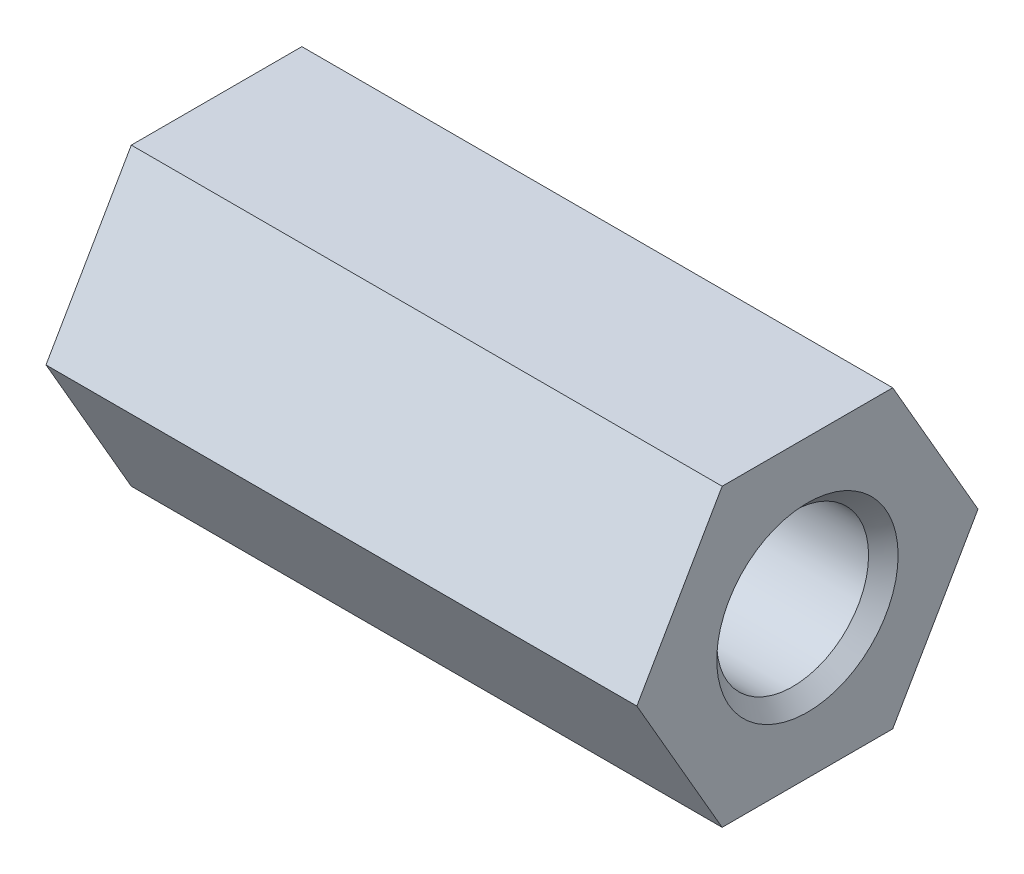
ISO-10303-21;
HEADER;
FILE_DESCRIPTION(('STEP AP214'),'2;1');
FILE_NAME('part.step','',(''),(''),'','','');
FILE_SCHEMA(('AUTOMOTIVE_DESIGN { 1 0 10303 214 1 1 1 1 }'));
ENDSEC;
DATA;
#1=APPLICATION_CONTEXT('core data for automotive mechanical design processes');
#2=APPLICATION_PROTOCOL_DEFINITION('international standard','automotive_design',2000,#1);
#3=PRODUCT_CONTEXT('',#1,'mechanical');
#4=PRODUCT('Part','Part','',(#3));
#5=PRODUCT_RELATED_PRODUCT_CATEGORY('part','',(#4));
#6=PRODUCT_DEFINITION_FORMATION('','',#4);
#7=PRODUCT_DEFINITION_CONTEXT('part definition',#1,'design');
#8=PRODUCT_DEFINITION('design','',#6,#7);
#9=PRODUCT_DEFINITION_SHAPE('','',#8);
#10=(LENGTH_UNIT() NAMED_UNIT(*) SI_UNIT(.MILLI.,.METRE.));
#11=(NAMED_UNIT(*) PLANE_ANGLE_UNIT() SI_UNIT($,.RADIAN.));
#12=(NAMED_UNIT(*) SI_UNIT($,.STERADIAN.) SOLID_ANGLE_UNIT());
#13=UNCERTAINTY_MEASURE_WITH_UNIT(LENGTH_MEASURE(1.E-05),#10,'distance_accuracy_value','');
#14=(GEOMETRIC_REPRESENTATION_CONTEXT(3) GLOBAL_UNCERTAINTY_ASSIGNED_CONTEXT((#13)) GLOBAL_UNIT_ASSIGNED_CONTEXT((#10,
#11,#12)) REPRESENTATION_CONTEXT('',''));
#15=CARTESIAN_POINT('',(0.,0.,0.));
#16=DIRECTION('',(0.,0.,1.));
#17=DIRECTION('',(1.,0.,0.));
#18=AXIS2_PLACEMENT_3D('',#15,#16,#17);
#19=CARTESIAN_POINT('',(25.4,-6.34999999999993,-3.66617420935418));
#20=DIRECTION('',(0.,0.499999999999995,0.866025403784441));
#21=DIRECTION('',(0.,-0.866025403784442,0.499999999999995));
#22=AXIS2_PLACEMENT_3D('',#19,#20,#21);
#23=PLANE('',#22);
#24=DIRECTION('',(0.,0.866025403784441,-0.499999999999995));
#25=VECTOR('',#24,1.);
#26=CARTESIAN_POINT('',(0.,-6.34999999999993,-3.66617420935418));
#27=LINE('',#26,#25);
#28=CARTESIAN_POINT('',(0.,-6.34999999999993,-3.66617420935418));
#29=VERTEX_POINT('',#28);
#30=CARTESIAN_POINT('',(0.,0.,-7.33234841870822));
#31=VERTEX_POINT('',#30);
#32=EDGE_CURVE('E117',#29,#31,#27,.T.);
#33=ORIENTED_EDGE('',*,*,#32,.T.);
#34=DIRECTION('',(-1.,0.,0.));
#35=VECTOR('',#34,1.);
#36=CARTESIAN_POINT('',(25.4,0.,-7.33234841870822));
#37=LINE('',#36,#35);
#38=CARTESIAN_POINT('',(25.4,0.,-7.33234841870822));
#39=VERTEX_POINT('',#38);
#40=EDGE_CURVE('E11',#39,#31,#37,.T.);
#41=ORIENTED_EDGE('',*,*,#40,.F.);
#42=DIRECTION('',(0.,0.866025403784441,-0.499999999999995));
#43=VECTOR('',#42,1.);
#44=CARTESIAN_POINT('',(25.4,-6.34999999999993,-3.66617420935418));
#45=LINE('',#44,#43);
#46=CARTESIAN_POINT('',(25.4,-6.34999999999993,-3.66617420935418));
#47=VERTEX_POINT('',#46);
#48=EDGE_CURVE('E128',#47,#39,#45,.T.);
#49=ORIENTED_EDGE('',*,*,#48,.F.);
#50=DIRECTION('',(-1.,0.,0.));
#51=VECTOR('',#50,1.);
#52=CARTESIAN_POINT('',(25.4,-6.34999999999993,-3.66617420935418));
#53=LINE('',#52,#51);
#54=EDGE_CURVE('E113',#47,#29,#53,.T.);
#55=ORIENTED_EDGE('',*,*,#54,.T.);
#56=EDGE_LOOP('',(#33,#41,#49,#55));
#57=FACE_BOUND('',#56,.T.);
#58=ADVANCED_FACE('F33',(#57),#23,.F.);
#59=CARTESIAN_POINT('',(25.4,0.,-7.33234841870822));
#60=DIRECTION('',(0.,-0.500000000000001,0.866025403784438));
#61=DIRECTION('',(0.,-0.866025403784438,-0.500000000000001));
#62=AXIS2_PLACEMENT_3D('',#59,#60,#61);
#63=PLANE('',#62);
#64=DIRECTION('',(0.,0.866025403784438,0.500000000000001));
#65=VECTOR('',#64,1.);
#66=CARTESIAN_POINT('',(0.,0.,-7.33234841870822));
#67=LINE('',#66,#65);
#68=CARTESIAN_POINT('',(0.,6.34999999999999,-3.6661742093541));
#69=VERTEX_POINT('',#68);
#70=EDGE_CURVE('E120',#31,#69,#67,.T.);
#71=ORIENTED_EDGE('',*,*,#70,.T.);
#72=DIRECTION('',(-1.,0.,0.));
#73=VECTOR('',#72,1.);
#74=CARTESIAN_POINT('',(25.4,6.34999999999999,-3.6661742093541));
#75=LINE('',#74,#73);
#76=CARTESIAN_POINT('',(25.4,6.34999999999999,-3.6661742093541));
#77=VERTEX_POINT('',#76);
#78=EDGE_CURVE('E41',#77,#69,#75,.T.);
#79=ORIENTED_EDGE('',*,*,#78,.F.);
#80=DIRECTION('',(0.,0.866025403784438,0.500000000000001));
#81=VECTOR('',#80,1.);
#82=CARTESIAN_POINT('',(25.4,0.,-7.33234841870822));
#83=LINE('',#82,#81);
#84=EDGE_CURVE('E86',#39,#77,#83,.T.);
#85=ORIENTED_EDGE('',*,*,#84,.F.);
#86=ORIENTED_EDGE('',*,*,#40,.T.);
#87=EDGE_LOOP('',(#71,#79,#85,#86));
#88=FACE_BOUND('',#87,.T.);
#89=ADVANCED_FACE('F153',(#88),#63,.F.);
#90=CARTESIAN_POINT('',(25.4,6.34999999999999,-3.6661742093541));
#91=DIRECTION('',(0.,-1.,0.));
#92=DIRECTION('',(0.,0.,-1.));
#93=AXIS2_PLACEMENT_3D('',#90,#91,#92);
#94=PLANE('',#93);
#95=DIRECTION('',(0.,0.,1.));
#96=VECTOR('',#95,1.);
#97=CARTESIAN_POINT('',(0.,6.34999999999999,-3.6661742093541));
#98=LINE('',#97,#96);
#99=CARTESIAN_POINT('',(0.,6.34999999999996,3.66617420935414));
#100=VERTEX_POINT('',#99);
#101=EDGE_CURVE('E123',#69,#100,#98,.T.);
#102=ORIENTED_EDGE('',*,*,#101,.T.);
#103=DIRECTION('',(-1.,0.,0.));
#104=VECTOR('',#103,1.);
#105=CARTESIAN_POINT('',(25.4,6.34999999999996,3.66617420935414));
#106=LINE('',#105,#104);
#107=CARTESIAN_POINT('',(25.4,6.34999999999996,3.66617420935414));
#108=VERTEX_POINT('',#107);
#109=EDGE_CURVE('E108',#108,#100,#106,.T.);
#110=ORIENTED_EDGE('',*,*,#109,.F.);
#111=DIRECTION('',(0.,0.,1.));
#112=VECTOR('',#111,1.);
#113=CARTESIAN_POINT('',(25.4,6.34999999999999,-3.6661742093541));
#114=LINE('',#113,#112);
#115=EDGE_CURVE('E99',#77,#108,#114,.T.);
#116=ORIENTED_EDGE('',*,*,#115,.F.);
#117=ORIENTED_EDGE('',*,*,#78,.T.);
#118=EDGE_LOOP('',(#102,#110,#116,#117));
#119=FACE_BOUND('',#118,.T.);
#120=ADVANCED_FACE('F134',(#119),#94,.F.);
#121=CARTESIAN_POINT('',(25.4,6.34999999999996,3.66617420935414));
#122=DIRECTION('',(0.,-0.499999999999995,-0.866025403784442));
#123=DIRECTION('',(0.,0.866025403784442,-0.499999999999995));
#124=AXIS2_PLACEMENT_3D('',#121,#122,#123);
#125=PLANE('',#124);
#126=DIRECTION('',(0.,-0.866025403784442,0.499999999999995));
#127=VECTOR('',#126,1.);
#128=CARTESIAN_POINT('',(0.,6.34999999999996,3.66617420935414));
#129=LINE('',#128,#127);
#130=CARTESIAN_POINT('',(0.,0.,7.33234841870822));
#131=VERTEX_POINT('',#130);
#132=EDGE_CURVE('E107',#100,#131,#129,.T.);
#133=ORIENTED_EDGE('',*,*,#132,.T.);
#134=DIRECTION('',(-1.,0.,0.));
#135=VECTOR('',#134,1.);
#136=CARTESIAN_POINT('',(25.4,0.,7.33234841870822));
#137=LINE('',#136,#135);
#138=CARTESIAN_POINT('',(25.4,0.,7.33234841870822));
#139=VERTEX_POINT('',#138);
#140=EDGE_CURVE('E104',#139,#131,#137,.T.);
#141=ORIENTED_EDGE('',*,*,#140,.F.);
#142=DIRECTION('',(0.,-0.866025403784442,0.499999999999995));
#143=VECTOR('',#142,1.);
#144=CARTESIAN_POINT('',(25.4,6.34999999999996,3.66617420935414));
#145=LINE('',#144,#143);
#146=EDGE_CURVE('E93',#108,#139,#145,.T.);
#147=ORIENTED_EDGE('',*,*,#146,.F.);
#148=ORIENTED_EDGE('',*,*,#109,.T.);
#149=EDGE_LOOP('',(#133,#141,#147,#148));
#150=FACE_BOUND('',#149,.T.);
#151=ADVANCED_FACE('F105',(#150),#125,.F.);
#152=CARTESIAN_POINT('',(25.4,0.,7.33234841870822));
#153=DIRECTION('',(0.,0.500000000000007,-0.866025403784435));
#154=DIRECTION('',(0.,0.866025403784435,0.500000000000007));
#155=AXIS2_PLACEMENT_3D('',#152,#153,#154);
#156=PLANE('',#155);
#157=DIRECTION('',(0.,-0.866025403784435,-0.500000000000007));
#158=VECTOR('',#157,1.);
#159=CARTESIAN_POINT('',(0.,0.,7.33234841870822));
#160=LINE('',#159,#158);
#161=CARTESIAN_POINT('',(0.,-6.35000000000001,3.66617420935405));
#162=VERTEX_POINT('',#161);
#163=EDGE_CURVE('E72',#131,#162,#160,.T.);
#164=ORIENTED_EDGE('',*,*,#163,.T.);
#165=DIRECTION('',(-1.,0.,0.));
#166=VECTOR('',#165,1.);
#167=CARTESIAN_POINT('',(25.4,-6.35000000000001,3.66617420935405));
#168=LINE('',#167,#166);
#169=CARTESIAN_POINT('',(25.4,-6.35000000000001,3.66617420935405));
#170=VERTEX_POINT('',#169);
#171=EDGE_CURVE('E109',#170,#162,#168,.T.);
#172=ORIENTED_EDGE('',*,*,#171,.F.);
#173=DIRECTION('',(0.,-0.866025403784435,-0.500000000000007));
#174=VECTOR('',#173,1.);
#175=CARTESIAN_POINT('',(25.4,0.,7.33234841870822));
#176=LINE('',#175,#174);
#177=EDGE_CURVE('E97',#139,#170,#176,.T.);
#178=ORIENTED_EDGE('',*,*,#177,.F.);
#179=ORIENTED_EDGE('',*,*,#140,.T.);
#180=EDGE_LOOP('',(#164,#172,#178,#179));
#181=FACE_BOUND('',#180,.T.);
#182=ADVANCED_FACE('F111',(#181),#156,.F.);
#183=CARTESIAN_POINT('',(25.4,-6.35000000000001,3.66617420935405));
#184=DIRECTION('',(0.,1.,0.));
#185=DIRECTION('',(0.,0.,1.));
#186=AXIS2_PLACEMENT_3D('',#183,#184,#185);
#187=PLANE('',#186);
#188=DIRECTION('',(0.,0.,-1.));
#189=VECTOR('',#188,1.);
#190=CARTESIAN_POINT('',(0.,-6.35000000000001,3.66617420935405));
#191=LINE('',#190,#189);
#192=EDGE_CURVE('E78',#162,#29,#191,.T.);
#193=ORIENTED_EDGE('',*,*,#192,.T.);
#194=ORIENTED_EDGE('',*,*,#54,.F.);
#195=DIRECTION('',(0.,0.,-1.));
#196=VECTOR('',#195,1.);
#197=CARTESIAN_POINT('',(25.4,-6.35000000000001,3.66617420935405));
#198=LINE('',#197,#196);
#199=EDGE_CURVE('E49',#170,#47,#198,.T.);
#200=ORIENTED_EDGE('',*,*,#199,.F.);
#201=ORIENTED_EDGE('',*,*,#171,.T.);
#202=EDGE_LOOP('',(#193,#194,#200,#201));
#203=FACE_BOUND('',#202,.T.);
#204=ADVANCED_FACE('F141',(#203),#187,.F.);
#205=CARTESIAN_POINT('',(25.4,0.,0.));
#206=DIRECTION('',(1.,0.,0.));
#207=DIRECTION('',(0.,0.,-1.));
#208=AXIS2_PLACEMENT_3D('',#205,#206,#207);
#209=PLANE('',#208);
#210=CARTESIAN_POINT('',(25.4,0.,0.));
#211=DIRECTION('',(1.,0.,0.));
#212=DIRECTION('',(0.,0.,-1.));
#213=AXIS2_PLACEMENT_3D('',#210,#211,#212);
#214=CIRCLE('',#213,3.8989);
#215=CARTESIAN_POINT('',(25.4,0.,-3.8989));
#216=VERTEX_POINT('',#215);
#217=EDGE_CURVE('E219',#216,#216,#214,.T.);
#218=ORIENTED_EDGE('',*,*,#217,.F.);
#219=EDGE_LOOP('',(#218));
#220=FACE_BOUND('',#219,.T.);
#221=ORIENTED_EDGE('',*,*,#48,.T.);
#222=ORIENTED_EDGE('',*,*,#84,.T.);
#223=ORIENTED_EDGE('',*,*,#115,.T.);
#224=ORIENTED_EDGE('',*,*,#146,.T.);
#225=ORIENTED_EDGE('',*,*,#177,.T.);
#226=ORIENTED_EDGE('',*,*,#199,.T.);
#227=EDGE_LOOP('',(#221,#222,#223,#224,#225,#226));
#228=FACE_BOUND('',#227,.T.);
#229=ADVANCED_FACE('F95',(#220,#228),#209,.T.);
#230=CARTESIAN_POINT('',(0.,0.,0.));
#231=DIRECTION('',(1.,0.,0.));
#232=DIRECTION('',(0.,0.,-1.));
#233=AXIS2_PLACEMENT_3D('',#230,#231,#232);
#234=PLANE('',#233);
#235=CARTESIAN_POINT('',(0.,0.,0.));
#236=DIRECTION('',(1.,0.,0.));
#237=DIRECTION('',(0.,0.,-1.));
#238=AXIS2_PLACEMENT_3D('',#235,#236,#237);
#239=CIRCLE('',#238,3.2639);
#240=CARTESIAN_POINT('',(0.,0.,-3.2639));
#241=VERTEX_POINT('',#240);
#242=EDGE_CURVE('E121',#241,#241,#239,.T.);
#243=ORIENTED_EDGE('',*,*,#242,.T.);
#244=EDGE_LOOP('',(#243));
#245=FACE_BOUND('',#244,.T.);
#246=ORIENTED_EDGE('',*,*,#32,.F.);
#247=ORIENTED_EDGE('',*,*,#192,.F.);
#248=ORIENTED_EDGE('',*,*,#163,.F.);
#249=ORIENTED_EDGE('',*,*,#132,.F.);
#250=ORIENTED_EDGE('',*,*,#101,.F.);
#251=ORIENTED_EDGE('',*,*,#70,.F.);
#252=EDGE_LOOP('',(#246,#247,#248,#249,#250,#251));
#253=FACE_BOUND('',#252,.T.);
#254=ADVANCED_FACE('F137',(#245,#253),#234,.F.);
#255=CARTESIAN_POINT('',(25.4,0.,0.));
#256=DIRECTION('',(1.,0.,0.));
#257=DIRECTION('',(0.,0.,-1.));
#258=AXIS2_PLACEMENT_3D('',#255,#256,#257);
#259=CYLINDRICAL_SURFACE('',#258,3.2639);
#260=ORIENTED_EDGE('',*,*,#242,.F.);
#261=EDGE_LOOP('',(#260));
#262=FACE_BOUND('',#261,.T.);
#263=CARTESIAN_POINT('',(24.765,0.,0.));
#264=DIRECTION('',(1.,0.,0.));
#265=DIRECTION('',(0.,0.,-1.));
#266=AXIS2_PLACEMENT_3D('',#263,#264,#265);
#267=CIRCLE('',#266,3.2639);
#268=CARTESIAN_POINT('',(24.765,0.,-3.2639));
#269=VERTEX_POINT('',#268);
#270=EDGE_CURVE('E216',#269,#269,#267,.T.);
#271=ORIENTED_EDGE('',*,*,#270,.T.);
#272=EDGE_LOOP('',(#271));
#273=FACE_BOUND('',#272,.T.);
#274=ADVANCED_FACE('F190',(#262,#273),#259,.F.);
#275=CARTESIAN_POINT('',(25.4,0.,0.));
#276=DIRECTION('',(1.,0.,0.));
#277=DIRECTION('',(0.,0.,-1.));
#278=AXIS2_PLACEMENT_3D('',#275,#276,#277);
#279=CONICAL_SURFACE('',#278,3.8989,0.785398163397448);
#280=ORIENTED_EDGE('',*,*,#270,.F.);
#281=EDGE_LOOP('',(#280));
#282=FACE_BOUND('',#281,.T.);
#283=ORIENTED_EDGE('',*,*,#217,.T.);
#284=EDGE_LOOP('',(#283));
#285=FACE_BOUND('',#284,.T.);
#286=ADVANCED_FACE('F199',(#282,#285),#279,.F.);
#287=CLOSED_SHELL('',(#58,#89,#120,#151,#182,#204,#229,#254,#274,#286));
#288=MANIFOLD_SOLID_BREP('B2',#287);
#289=ADVANCED_BREP_SHAPE_REPRESENTATION('',(#18,#288),#14);
#290=SHAPE_DEFINITION_REPRESENTATION(#9,#289);
ENDSEC;
END-ISO-10303-21;
